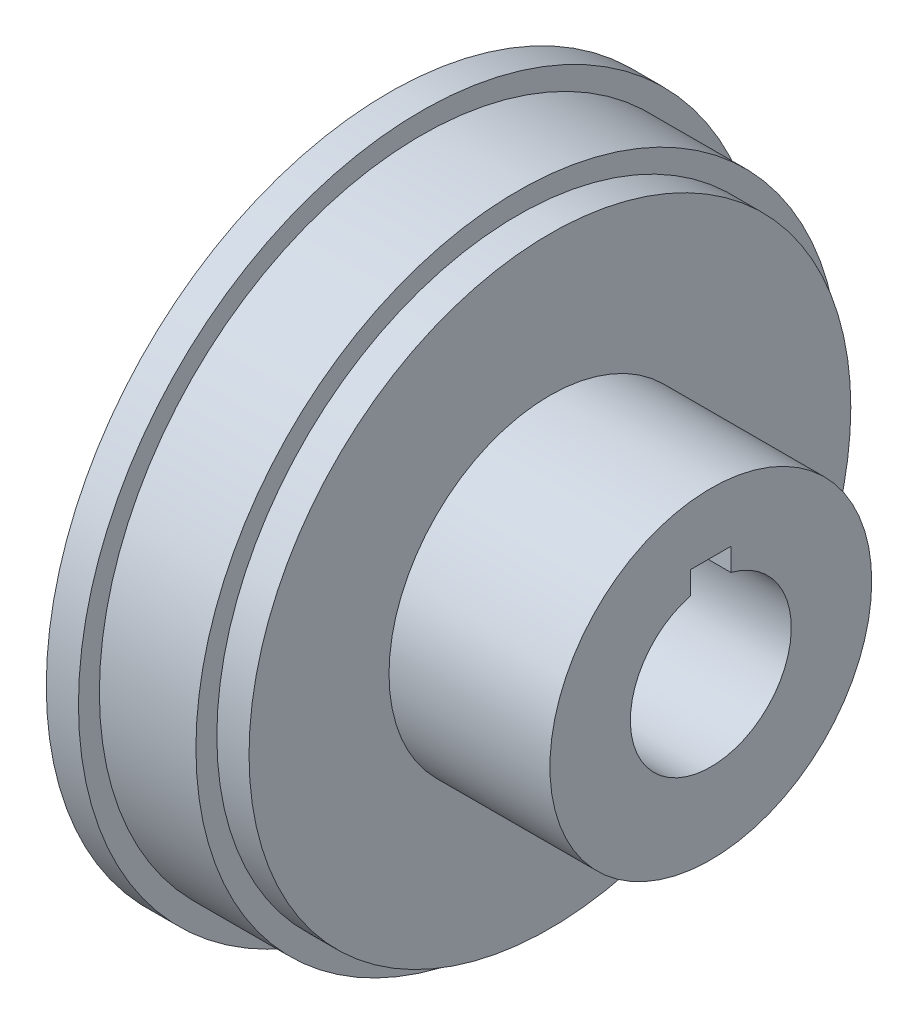
ISO-10303-21;
HEADER;
FILE_DESCRIPTION(('STEP AP214'),'2;1');
FILE_NAME('part.step','',(''),(''),'','','');
FILE_SCHEMA(('AUTOMOTIVE_DESIGN { 1 0 10303 214 1 1 1 1 }'));
ENDSEC;
DATA;
#1=APPLICATION_CONTEXT('core data for automotive mechanical design processes');
#2=APPLICATION_PROTOCOL_DEFINITION('international standard','automotive_design',2000,#1);
#3=PRODUCT_CONTEXT('',#1,'mechanical');
#4=PRODUCT('Part','Part','',(#3));
#5=PRODUCT_RELATED_PRODUCT_CATEGORY('part','',(#4));
#6=PRODUCT_DEFINITION_FORMATION('','',#4);
#7=PRODUCT_DEFINITION_CONTEXT('part definition',#1,'design');
#8=PRODUCT_DEFINITION('design','',#6,#7);
#9=PRODUCT_DEFINITION_SHAPE('','',#8);
#10=(LENGTH_UNIT() NAMED_UNIT(*) SI_UNIT(.MILLI.,.METRE.));
#11=(NAMED_UNIT(*) PLANE_ANGLE_UNIT() SI_UNIT($,.RADIAN.));
#12=(NAMED_UNIT(*) SI_UNIT($,.STERADIAN.) SOLID_ANGLE_UNIT());
#13=UNCERTAINTY_MEASURE_WITH_UNIT(LENGTH_MEASURE(1.E-05),#10,'distance_accuracy_value','');
#14=(GEOMETRIC_REPRESENTATION_CONTEXT(3) GLOBAL_UNCERTAINTY_ASSIGNED_CONTEXT((#13)) GLOBAL_UNIT_ASSIGNED_CONTEXT((#10,
#11,#12)) REPRESENTATION_CONTEXT('',''));
#15=CARTESIAN_POINT('',(0.,0.,0.));
#16=DIRECTION('',(0.,0.,1.));
#17=DIRECTION('',(1.,0.,0.));
#18=AXIS2_PLACEMENT_3D('',#15,#16,#17);
#19=CARTESIAN_POINT('',(12.7,0.,0.));
#20=DIRECTION('',(-1.,0.,0.));
#21=DIRECTION('',(0.,0.,1.));
#22=AXIS2_PLACEMENT_3D('',#19,#20,#21);
#23=CYLINDRICAL_SURFACE('',#22,25.4);
#24=CARTESIAN_POINT('',(2.54,0.,0.));
#25=DIRECTION('',(-1.,0.,0.));
#26=DIRECTION('',(0.,0.,1.));
#27=AXIS2_PLACEMENT_3D('',#24,#25,#26);
#28=CIRCLE('',#27,25.4);
#29=CARTESIAN_POINT('',(2.54,0.,25.4));
#30=VERTEX_POINT('',#29);
#31=EDGE_CURVE('E254',#30,#30,#28,.T.);
#32=ORIENTED_EDGE('',*,*,#31,.F.);
#33=EDGE_LOOP('',(#32));
#34=FACE_BOUND('',#33,.T.);
#35=CARTESIAN_POINT('',(10.16,0.,0.));
#36=DIRECTION('',(1.,0.,0.));
#37=DIRECTION('',(0.,0.,-1.));
#38=AXIS2_PLACEMENT_3D('',#35,#36,#37);
#39=CIRCLE('',#38,25.4);
#40=CARTESIAN_POINT('',(10.16,0.,-25.4));
#41=VERTEX_POINT('',#40);
#42=EDGE_CURVE('E249',#41,#41,#39,.T.);
#43=ORIENTED_EDGE('',*,*,#42,.F.);
#44=EDGE_LOOP('',(#43));
#45=FACE_BOUND('',#44,.T.);
#46=ADVANCED_FACE('F34',(#34,#45),#23,.T.);
#47=CARTESIAN_POINT('',(12.7,0.,0.));
#48=DIRECTION('',(-1.,0.,0.));
#49=DIRECTION('',(0.,0.,1.));
#50=AXIS2_PLACEMENT_3D('',#47,#48,#49);
#51=PLANE('',#50);
#52=CARTESIAN_POINT('',(12.7,0.,0.));
#53=DIRECTION('',(-1.,0.,0.));
#54=DIRECTION('',(0.,0.,1.));
#55=AXIS2_PLACEMENT_3D('',#52,#53,#54);
#56=CIRCLE('',#55,12.7);
#57=CARTESIAN_POINT('',(12.7,0.,12.7));
#58=VERTEX_POINT('',#57);
#59=EDGE_CURVE('E103',#58,#58,#56,.F.);
#60=ORIENTED_EDGE('',*,*,#59,.F.);
#61=EDGE_LOOP('',(#60));
#62=FACE_BOUND('',#61,.T.);
#63=CARTESIAN_POINT('',(12.7,0.,0.));
#64=DIRECTION('',(1.,0.,0.));
#65=DIRECTION('',(0.,0.,-1.));
#66=AXIS2_PLACEMENT_3D('',#63,#64,#65);
#67=CIRCLE('',#66,23.749);
#68=CARTESIAN_POINT('',(12.7,0.,-23.749));
#69=VERTEX_POINT('',#68);
#70=EDGE_CURVE('E246',#69,#69,#67,.T.);
#71=ORIENTED_EDGE('',*,*,#70,.T.);
#72=EDGE_LOOP('',(#71));
#73=FACE_BOUND('',#72,.T.);
#74=ADVANCED_FACE('F119',(#62,#73),#51,.F.);
#75=CARTESIAN_POINT('',(25.4,0.,0.));
#76=DIRECTION('',(1.,0.,0.));
#77=DIRECTION('',(0.,0.,-1.));
#78=AXIS2_PLACEMENT_3D('',#75,#76,#77);
#79=PLANE('',#78);
#80=CARTESIAN_POINT('',(25.4,0.,0.));
#81=DIRECTION('',(1.,0.,0.));
#82=DIRECTION('',(0.,0.,-1.));
#83=AXIS2_PLACEMENT_3D('',#80,#81,#82);
#84=CIRCLE('',#83,6.35);
#85=CARTESIAN_POINT('',(25.4,6.14836106210428,1.5875));
#86=VERTEX_POINT('',#85);
#87=CARTESIAN_POINT('',(25.4,6.14836106210427,-1.5875));
#88=VERTEX_POINT('',#87);
#89=EDGE_CURVE('E93',#86,#88,#84,.T.);
#90=ORIENTED_EDGE('',*,*,#89,.F.);
#91=DIRECTION('',(0.,-1.,0.));
#92=VECTOR('',#91,1.);
#93=CARTESIAN_POINT('',(25.4,0.,1.5875));
#94=LINE('',#93,#92);
#95=CARTESIAN_POINT('',(25.4,7.9375,1.5875));
#96=VERTEX_POINT('',#95);
#97=EDGE_CURVE('E84',#96,#86,#94,.T.);
#98=ORIENTED_EDGE('',*,*,#97,.F.);
#99=DIRECTION('',(0.,0.,-1.));
#100=VECTOR('',#99,1.);
#101=CARTESIAN_POINT('',(25.4,7.9375,0.));
#102=LINE('',#101,#100);
#103=CARTESIAN_POINT('',(25.4,7.9375,-1.5875));
#104=VERTEX_POINT('',#103);
#105=EDGE_CURVE('E88',#96,#104,#102,.T.);
#106=ORIENTED_EDGE('',*,*,#105,.T.);
#107=DIRECTION('',(0.,-1.,0.));
#108=VECTOR('',#107,1.);
#109=CARTESIAN_POINT('',(25.4,0.,-1.5875));
#110=LINE('',#109,#108);
#111=EDGE_CURVE('E51',#104,#88,#110,.T.);
#112=ORIENTED_EDGE('',*,*,#111,.T.);
#113=EDGE_LOOP('',(#90,#98,#106,#112));
#114=FACE_BOUND('',#113,.T.);
#115=CARTESIAN_POINT('',(25.4,0.,0.));
#116=DIRECTION('',(1.,0.,0.));
#117=DIRECTION('',(0.,0.,-1.));
#118=AXIS2_PLACEMENT_3D('',#115,#116,#117);
#119=CIRCLE('',#118,12.7);
#120=CARTESIAN_POINT('',(25.4,0.,-12.7));
#121=VERTEX_POINT('',#120);
#122=EDGE_CURVE('E261',#121,#121,#119,.T.);
#123=ORIENTED_EDGE('',*,*,#122,.T.);
#124=EDGE_LOOP('',(#123));
#125=FACE_BOUND('',#124,.T.);
#126=ADVANCED_FACE('F91',(#114,#125),#79,.T.);
#127=CARTESIAN_POINT('',(25.4,0.,0.));
#128=DIRECTION('',(-1.,0.,0.));
#129=DIRECTION('',(0.,0.,1.));
#130=AXIS2_PLACEMENT_3D('',#127,#128,#129);
#131=CYLINDRICAL_SURFACE('',#130,6.35);
#132=CARTESIAN_POINT('',(0.,0.,0.));
#133=DIRECTION('',(1.,0.,0.));
#134=DIRECTION('',(0.,0.,-1.));
#135=AXIS2_PLACEMENT_3D('',#132,#133,#134);
#136=CIRCLE('',#135,6.35);
#137=CARTESIAN_POINT('',(0.,6.14836106210428,1.5875));
#138=VERTEX_POINT('',#137);
#139=CARTESIAN_POINT('',(0.,6.14836106210427,-1.5875));
#140=VERTEX_POINT('',#139);
#141=EDGE_CURVE('E100',#138,#140,#136,.T.);
#142=ORIENTED_EDGE('',*,*,#141,.F.);
#143=DIRECTION('',(-1.,0.,0.));
#144=VECTOR('',#143,1.);
#145=CARTESIAN_POINT('',(25.4,6.14836106210428,1.5875));
#146=LINE('',#145,#144);
#147=EDGE_CURVE('E11',#86,#138,#146,.T.);
#148=ORIENTED_EDGE('',*,*,#147,.F.);
#149=ORIENTED_EDGE('',*,*,#89,.T.);
#150=DIRECTION('',(-1.,0.,0.));
#151=VECTOR('',#150,1.);
#152=CARTESIAN_POINT('',(25.4,6.14836106210427,-1.5875));
#153=LINE('',#152,#151);
#154=EDGE_CURVE('E73',#88,#140,#153,.T.);
#155=ORIENTED_EDGE('',*,*,#154,.T.);
#156=EDGE_LOOP('',(#142,#148,#149,#155));
#157=FACE_BOUND('',#156,.T.);
#158=ADVANCED_FACE('F36',(#157),#131,.F.);
#159=CARTESIAN_POINT('',(25.4,0.,1.5875));
#160=DIRECTION('',(0.,0.,-1.));
#161=DIRECTION('',(0.,1.,0.));
#162=AXIS2_PLACEMENT_3D('',#159,#160,#161);
#163=PLANE('',#162);
#164=DIRECTION('',(0.,-1.,0.));
#165=VECTOR('',#164,1.);
#166=CARTESIAN_POINT('',(0.,0.,1.5875));
#167=LINE('',#166,#165);
#168=CARTESIAN_POINT('',(0.,7.9375,1.5875));
#169=VERTEX_POINT('',#168);
#170=EDGE_CURVE('E86',#169,#138,#167,.T.);
#171=ORIENTED_EDGE('',*,*,#170,.F.);
#172=DIRECTION('',(-1.,0.,0.));
#173=VECTOR('',#172,1.);
#174=CARTESIAN_POINT('',(25.4,7.9375,1.5875));
#175=LINE('',#174,#173);
#176=EDGE_CURVE('E43',#96,#169,#175,.T.);
#177=ORIENTED_EDGE('',*,*,#176,.F.);
#178=ORIENTED_EDGE('',*,*,#97,.T.);
#179=ORIENTED_EDGE('',*,*,#147,.T.);
#180=EDGE_LOOP('',(#171,#177,#178,#179));
#181=FACE_BOUND('',#180,.T.);
#182=ADVANCED_FACE('F82',(#181),#163,.T.);
#183=CARTESIAN_POINT('',(25.4,7.9375,0.));
#184=DIRECTION('',(0.,1.,0.));
#185=DIRECTION('',(0.,0.,1.));
#186=AXIS2_PLACEMENT_3D('',#183,#184,#185);
#187=PLANE('',#186);
#188=DIRECTION('',(0.,0.,-1.));
#189=VECTOR('',#188,1.);
#190=CARTESIAN_POINT('',(0.,7.9375,0.));
#191=LINE('',#190,#189);
#192=CARTESIAN_POINT('',(0.,7.9375,-1.5875));
#193=VERTEX_POINT('',#192);
#194=EDGE_CURVE('E66',#169,#193,#191,.T.);
#195=ORIENTED_EDGE('',*,*,#194,.T.);
#196=DIRECTION('',(-1.,0.,0.));
#197=VECTOR('',#196,1.);
#198=CARTESIAN_POINT('',(25.4,7.9375,-1.5875));
#199=LINE('',#198,#197);
#200=EDGE_CURVE('E87',#104,#193,#199,.T.);
#201=ORIENTED_EDGE('',*,*,#200,.F.);
#202=ORIENTED_EDGE('',*,*,#105,.F.);
#203=ORIENTED_EDGE('',*,*,#176,.T.);
#204=EDGE_LOOP('',(#195,#201,#202,#203));
#205=FACE_BOUND('',#204,.T.);
#206=ADVANCED_FACE('F89',(#205),#187,.F.);
#207=CARTESIAN_POINT('',(25.4,0.,-1.5875));
#208=DIRECTION('',(0.,0.,-1.));
#209=DIRECTION('',(0.,1.,0.));
#210=AXIS2_PLACEMENT_3D('',#207,#208,#209);
#211=PLANE('',#210);
#212=DIRECTION('',(0.,-1.,0.));
#213=VECTOR('',#212,1.);
#214=CARTESIAN_POINT('',(0.,0.,-1.5875));
#215=LINE('',#214,#213);
#216=EDGE_CURVE('E95',#193,#140,#215,.T.);
#217=ORIENTED_EDGE('',*,*,#216,.T.);
#218=ORIENTED_EDGE('',*,*,#154,.F.);
#219=ORIENTED_EDGE('',*,*,#111,.F.);
#220=ORIENTED_EDGE('',*,*,#200,.T.);
#221=EDGE_LOOP('',(#217,#218,#219,#220));
#222=FACE_BOUND('',#221,.T.);
#223=ADVANCED_FACE('F110',(#222),#211,.F.);
#224=CARTESIAN_POINT('',(0.,0.,0.));
#225=DIRECTION('',(1.,0.,0.));
#226=DIRECTION('',(0.,0.,-1.));
#227=AXIS2_PLACEMENT_3D('',#224,#225,#226);
#228=PLANE('',#227);
#229=ORIENTED_EDGE('',*,*,#141,.T.);
#230=ORIENTED_EDGE('',*,*,#216,.F.);
#231=ORIENTED_EDGE('',*,*,#194,.F.);
#232=ORIENTED_EDGE('',*,*,#170,.T.);
#233=EDGE_LOOP('',(#229,#230,#231,#232));
#234=FACE_BOUND('',#233,.T.);
#235=CARTESIAN_POINT('',(0.,0.,0.));
#236=DIRECTION('',(-1.,0.,0.));
#237=DIRECTION('',(0.,0.,1.));
#238=AXIS2_PLACEMENT_3D('',#235,#236,#237);
#239=CIRCLE('',#238,27.051);
#240=CARTESIAN_POINT('',(0.,0.,27.051));
#241=VERTEX_POINT('',#240);
#242=EDGE_CURVE('E257',#241,#241,#239,.T.);
#243=ORIENTED_EDGE('',*,*,#242,.T.);
#244=EDGE_LOOP('',(#243));
#245=FACE_BOUND('',#244,.T.);
#246=ADVANCED_FACE('F112',(#234,#245),#228,.F.);
#247=CARTESIAN_POINT('',(-59.1420489685532,0.,0.));
#248=DIRECTION('',(1.,0.,0.));
#249=DIRECTION('',(0.,0.,-1.));
#250=AXIS2_PLACEMENT_3D('',#247,#248,#249);
#251=CYLINDRICAL_SURFACE('',#250,12.7);
#252=ORIENTED_EDGE('',*,*,#122,.F.);
#253=EDGE_LOOP('',(#252));
#254=FACE_BOUND('',#253,.T.);
#255=ORIENTED_EDGE('',*,*,#59,.T.);
#256=EDGE_LOOP('',(#255));
#257=FACE_BOUND('',#256,.T.);
#258=ADVANCED_FACE('F135',(#254,#257),#251,.T.);
#259=CARTESIAN_POINT('',(2.54,0.,0.));
#260=DIRECTION('',(-1.,0.,0.));
#261=DIRECTION('',(0.,0.,1.));
#262=AXIS2_PLACEMENT_3D('',#259,#260,#261);
#263=CYLINDRICAL_SURFACE('',#262,27.051);
#264=CARTESIAN_POINT('',(2.54,0.,0.));
#265=DIRECTION('',(-1.,0.,0.));
#266=DIRECTION('',(0.,0.,1.));
#267=AXIS2_PLACEMENT_3D('',#264,#265,#266);
#268=CIRCLE('',#267,27.051);
#269=CARTESIAN_POINT('',(2.54,0.,27.051));
#270=VERTEX_POINT('',#269);
#271=EDGE_CURVE('E258',#270,#270,#268,.T.);
#272=ORIENTED_EDGE('',*,*,#271,.T.);
#273=EDGE_LOOP('',(#272));
#274=FACE_BOUND('',#273,.T.);
#275=ORIENTED_EDGE('',*,*,#242,.F.);
#276=EDGE_LOOP('',(#275));
#277=FACE_BOUND('',#276,.T.);
#278=ADVANCED_FACE('F159',(#274,#277),#263,.T.);
#279=CARTESIAN_POINT('',(2.54,0.,0.));
#280=DIRECTION('',(-1.,0.,0.));
#281=DIRECTION('',(0.,0.,1.));
#282=AXIS2_PLACEMENT_3D('',#279,#280,#281);
#283=PLANE('',#282);
#284=ORIENTED_EDGE('',*,*,#31,.T.);
#285=EDGE_LOOP('',(#284));
#286=FACE_BOUND('',#285,.T.);
#287=ORIENTED_EDGE('',*,*,#271,.F.);
#288=EDGE_LOOP('',(#287));
#289=FACE_BOUND('',#288,.T.);
#290=ADVANCED_FACE('F165',(#286,#289),#283,.F.);
#291=CARTESIAN_POINT('',(10.16,0.,0.));
#292=DIRECTION('',(1.,0.,0.));
#293=DIRECTION('',(0.,0.,-1.));
#294=AXIS2_PLACEMENT_3D('',#291,#292,#293);
#295=PLANE('',#294);
#296=CARTESIAN_POINT('',(10.16,0.,0.));
#297=DIRECTION('',(1.,0.,0.));
#298=DIRECTION('',(0.,0.,-1.));
#299=AXIS2_PLACEMENT_3D('',#296,#297,#298);
#300=CIRCLE('',#299,23.749);
#301=CARTESIAN_POINT('',(10.16,0.,-23.749));
#302=VERTEX_POINT('',#301);
#303=EDGE_CURVE('E243',#302,#302,#300,.T.);
#304=ORIENTED_EDGE('',*,*,#303,.F.);
#305=EDGE_LOOP('',(#304));
#306=FACE_BOUND('',#305,.T.);
#307=ORIENTED_EDGE('',*,*,#42,.T.);
#308=EDGE_LOOP('',(#307));
#309=FACE_BOUND('',#308,.T.);
#310=ADVANCED_FACE('F173',(#306,#309),#295,.T.);
#311=CARTESIAN_POINT('',(10.16,0.,0.));
#312=DIRECTION('',(1.,0.,0.));
#313=DIRECTION('',(0.,0.,-1.));
#314=AXIS2_PLACEMENT_3D('',#311,#312,#313);
#315=CYLINDRICAL_SURFACE('',#314,23.749);
#316=ORIENTED_EDGE('',*,*,#303,.T.);
#317=EDGE_LOOP('',(#316));
#318=FACE_BOUND('',#317,.T.);
#319=ORIENTED_EDGE('',*,*,#70,.F.);
#320=EDGE_LOOP('',(#319));
#321=FACE_BOUND('',#320,.T.);
#322=ADVANCED_FACE('F181',(#318,#321),#315,.T.);
#323=CLOSED_SHELL('',(#46,#74,#126,#158,#182,#206,#223,#246,#258,#278,#290,#310,#322));
#324=MANIFOLD_SOLID_BREP('B2',#323);
#325=ADVANCED_BREP_SHAPE_REPRESENTATION('',(#18,#324),#14);
#326=SHAPE_DEFINITION_REPRESENTATION(#9,#325);
ENDSEC;
END-ISO-10303-21;
